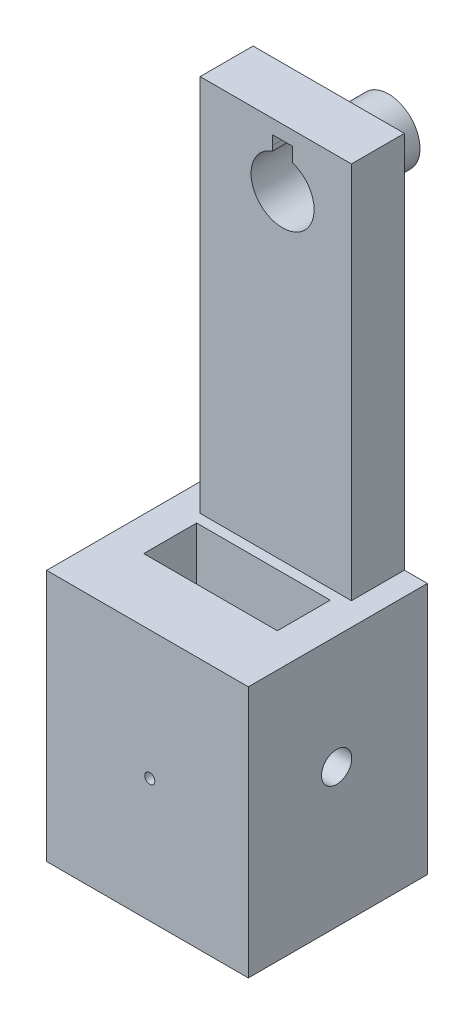
ISO-10303-21;
HEADER;
FILE_DESCRIPTION(('STEP AP214'),'2;1');
FILE_NAME('part.step','',(''),(''),'','','');
FILE_SCHEMA(('AUTOMOTIVE_DESIGN { 1 0 10303 214 1 1 1 1 }'));
ENDSEC;
DATA;
#1=APPLICATION_CONTEXT('core data for automotive mechanical design processes');
#2=APPLICATION_PROTOCOL_DEFINITION('international standard','automotive_design',2000,#1);
#3=PRODUCT_CONTEXT('',#1,'mechanical');
#4=PRODUCT('Part','Part','',(#3));
#5=PRODUCT_RELATED_PRODUCT_CATEGORY('part','',(#4));
#6=PRODUCT_DEFINITION_FORMATION('','',#4);
#7=PRODUCT_DEFINITION_CONTEXT('part definition',#1,'design');
#8=PRODUCT_DEFINITION('design','',#6,#7);
#9=PRODUCT_DEFINITION_SHAPE('','',#8);
#10=(LENGTH_UNIT() NAMED_UNIT(*) SI_UNIT(.MILLI.,.METRE.));
#11=(NAMED_UNIT(*) PLANE_ANGLE_UNIT() SI_UNIT($,.RADIAN.));
#12=(NAMED_UNIT(*) SI_UNIT($,.STERADIAN.) SOLID_ANGLE_UNIT());
#13=UNCERTAINTY_MEASURE_WITH_UNIT(LENGTH_MEASURE(1.E-05),#10,'distance_accuracy_value','');
#14=(GEOMETRIC_REPRESENTATION_CONTEXT(3) GLOBAL_UNCERTAINTY_ASSIGNED_CONTEXT((#13)) GLOBAL_UNIT_ASSIGNED_CONTEXT((#10,
#11,#12)) REPRESENTATION_CONTEXT('',''));
#15=CARTESIAN_POINT('',(0.,0.,0.));
#16=DIRECTION('',(0.,0.,1.));
#17=DIRECTION('',(1.,0.,0.));
#18=AXIS2_PLACEMENT_3D('',#15,#16,#17);
#19=CARTESIAN_POINT('',(-25.012791673449,9.50780152048557,-22.));
#20=DIRECTION('',(0.,0.,1.));
#21=DIRECTION('',(1.,0.,0.));
#22=AXIS2_PLACEMENT_3D('',#19,#20,#21);
#23=CYLINDRICAL_SURFACE('',#22,12.5);
#24=CARTESIAN_POINT('',(-25.012791673449,9.50780152048557,-22.));
#25=DIRECTION('',(0.,0.,-1.));
#26=DIRECTION('',(-1.,0.,0.));
#27=AXIS2_PLACEMENT_3D('',#24,#25,#26);
#28=CIRCLE('',#27,12.5);
#29=CARTESIAN_POINT('',(-37.512791673449,9.50780152048557,-22.));
#30=VERTEX_POINT('',#29);
#31=EDGE_CURVE('E11',#30,#30,#28,.T.);
#32=ORIENTED_EDGE('',*,*,#31,.F.);
#33=EDGE_LOOP('',(#32));
#34=FACE_BOUND('',#33,.T.);
#35=CARTESIAN_POINT('',(-25.012791673449,9.50780152048557,-2.));
#36=DIRECTION('',(0.,0.,-1.));
#37=DIRECTION('',(-1.,0.,0.));
#38=AXIS2_PLACEMENT_3D('',#35,#36,#37);
#39=CIRCLE('',#38,12.5);
#40=CARTESIAN_POINT('',(-37.512791673449,9.50780152048557,-2.));
#41=VERTEX_POINT('',#40);
#42=EDGE_CURVE('E53',#41,#41,#39,.T.);
#43=ORIENTED_EDGE('',*,*,#42,.T.);
#44=EDGE_LOOP('',(#43));
#45=FACE_BOUND('',#44,.T.);
#46=ADVANCED_FACE('F50',(#34,#45),#23,.T.);
#47=CARTESIAN_POINT('',(-25.012791673449,9.50780152048557,-22.));
#48=DIRECTION('',(0.,0.,-1.));
#49=DIRECTION('',(-1.,0.,0.));
#50=AXIS2_PLACEMENT_3D('',#47,#48,#49);
#51=PLANE('',#50);
#52=ORIENTED_EDGE('',*,*,#31,.T.);
#53=EDGE_LOOP('',(#52));
#54=FACE_BOUND('',#53,.T.);
#55=ADVANCED_FACE('F67',(#54),#51,.T.);
#56=CARTESIAN_POINT('',(-25.012791673449,9.50780152048557,-2.));
#57=DIRECTION('',(0.,0.,-1.));
#58=DIRECTION('',(-1.,0.,0.));
#59=AXIS2_PLACEMENT_3D('',#56,#57,#58);
#60=PLANE('',#59);
#61=ORIENTED_EDGE('',*,*,#42,.F.);
#62=EDGE_LOOP('',(#61));
#63=FACE_BOUND('',#62,.T.);
#64=ADVANCED_FACE('F65',(#63),#60,.F.);
#65=CLOSED_SHELL('',(#46,#55,#64));
#66=MANIFOLD_SOLID_BREP('B2',#65);
#67=CARTESIAN_POINT('',(-68.5841313388752,0.,-1.));
#68=DIRECTION('',(-1.,0.,0.));
#69=DIRECTION('',(0.,-1.,0.));
#70=AXIS2_PLACEMENT_3D('',#67,#68,#69);
#71=PLANE('',#70);
#72=CARTESIAN_POINT('',(-68.5841313388752,-162.375665535262,35.));
#73=DIRECTION('',(-1.,0.,0.));
#74=DIRECTION('',(0.,-1.,0.));
#75=AXIS2_PLACEMENT_3D('',#72,#73,#74);
#76=CIRCLE('',#75,6.);
#77=CARTESIAN_POINT('',(-68.5841313388752,-168.375665535262,35.));
#78=VERTEX_POINT('',#77);
#79=EDGE_CURVE('E428',#78,#78,#76,.T.);
#80=ORIENTED_EDGE('',*,*,#79,.F.);
#81=EDGE_LOOP('',(#80));
#82=FACE_BOUND('',#81,.T.);
#83=DIRECTION('',(0.,0.,1.));
#84=VECTOR('',#83,1.);
#85=CARTESIAN_POINT('',(-68.5841313388752,-217.375665535262,-1.));
#86=LINE('',#85,#84);
#87=CARTESIAN_POINT('',(-68.5841313388752,-217.375665535262,-1.));
#88=VERTEX_POINT('',#87);
#89=CARTESIAN_POINT('',(-68.5841313388752,-217.375665535262,70.));
#90=VERTEX_POINT('',#89);
#91=EDGE_CURVE('E402',#88,#90,#86,.T.);
#92=ORIENTED_EDGE('',*,*,#91,.T.);
#93=DIRECTION('',(0.,-1.,0.));
#94=VECTOR('',#93,1.);
#95=CARTESIAN_POINT('',(-68.5841313388752,-217.375665535262,70.));
#96=LINE('',#95,#94);
#97=CARTESIAN_POINT('',(-68.5841313388752,-117.375665535262,70.));
#98=VERTEX_POINT('',#97);
#99=EDGE_CURVE('E271',#98,#90,#96,.T.);
#100=ORIENTED_EDGE('',*,*,#99,.F.);
#101=DIRECTION('',(0.,0.,1.));
#102=VECTOR('',#101,1.);
#103=CARTESIAN_POINT('',(-68.5841313388752,-117.375665535262,-1.));
#104=LINE('',#103,#102);
#105=CARTESIAN_POINT('',(-68.5841313388752,-117.375665535262,-1.));
#106=VERTEX_POINT('',#105);
#107=EDGE_CURVE('E380',#106,#98,#104,.T.);
#108=ORIENTED_EDGE('',*,*,#107,.F.);
#109=DIRECTION('',(0.,-1.,0.));
#110=VECTOR('',#109,1.);
#111=CARTESIAN_POINT('',(-68.5841313388752,0.,-1.));
#112=LINE('',#111,#110);
#113=EDGE_CURVE('E348',#106,#88,#112,.T.);
#114=ORIENTED_EDGE('',*,*,#113,.T.);
#115=EDGE_LOOP('',(#92,#100,#108,#114));
#116=FACE_BOUND('',#115,.T.);
#117=ADVANCED_FACE('F95',(#82,#116),#71,.T.);
#118=CARTESIAN_POINT('',(-1.49699533291543E-13,-117.375665535262,-1.));
#119=DIRECTION('',(0.,1.,0.));
#120=DIRECTION('',(-1.,0.,0.));
#121=AXIS2_PLACEMENT_3D('',#118,#119,#120);
#122=PLANE('',#121);
#123=DIRECTION('',(0.,0.,1.));
#124=VECTOR('',#123,1.);
#125=CARTESIAN_POINT('',(-55.0841313388752,-117.375665535262,-1.00000000000004));
#126=LINE('',#125,#124);
#127=CARTESIAN_POINT('',(-55.0841313388752,-117.375665535262,24.));
#128=VERTEX_POINT('',#127);
#129=CARTESIAN_POINT('',(-55.0841313388752,-117.375665535262,45.));
#130=VERTEX_POINT('',#129);
#131=EDGE_CURVE('E268',#128,#130,#126,.T.);
#132=ORIENTED_EDGE('',*,*,#131,.F.);
#133=DIRECTION('',(-1.,0.,0.));
#134=VECTOR('',#133,1.);
#135=CARTESIAN_POINT('',(-1.49699533291543E-13,-117.375665535262,24.));
#136=LINE('',#135,#134);
#137=CARTESIAN_POINT('',(-2.08413133887517,-117.375665535262,24.));
#138=VERTEX_POINT('',#137);
#139=EDGE_CURVE('E256',#138,#128,#136,.T.);
#140=ORIENTED_EDGE('',*,*,#139,.F.);
#141=DIRECTION('',(0.,0.,-1.));
#142=VECTOR('',#141,1.);
#143=CARTESIAN_POINT('',(-2.08413133887516,-117.375665535262,-1.));
#144=LINE('',#143,#142);
#145=CARTESIAN_POINT('',(-2.08413133887517,-117.375665535262,45.));
#146=VERTEX_POINT('',#145);
#147=EDGE_CURVE('E229',#146,#138,#144,.T.);
#148=ORIENTED_EDGE('',*,*,#147,.F.);
#149=DIRECTION('',(1.,0.,0.));
#150=VECTOR('',#149,1.);
#151=CARTESIAN_POINT('',(-1.61744405728514E-13,-117.375665535262,45.));
#152=LINE('',#151,#150);
#153=EDGE_CURVE('E265',#130,#146,#152,.T.);
#154=ORIENTED_EDGE('',*,*,#153,.F.);
#155=EDGE_LOOP('',(#132,#140,#148,#154));
#156=FACE_BOUND('',#155,.T.);
#157=ORIENTED_EDGE('',*,*,#107,.T.);
#158=DIRECTION('',(-1.,0.,0.));
#159=VECTOR('',#158,1.);
#160=CARTESIAN_POINT('',(-68.5841313388752,-117.375665535262,70.));
#161=LINE('',#160,#159);
#162=CARTESIAN_POINT('',(11.4158686611248,-117.375665535262,70.));
#163=VERTEX_POINT('',#162);
#164=EDGE_CURVE('E283',#163,#98,#161,.T.);
#165=ORIENTED_EDGE('',*,*,#164,.F.);
#166=DIRECTION('',(0.,0.,1.));
#167=VECTOR('',#166,1.);
#168=CARTESIAN_POINT('',(11.4158686611248,-117.375665535262,-1.));
#169=LINE('',#168,#167);
#170=CARTESIAN_POINT('',(11.4158686611248,-117.375665535262,-1.));
#171=VERTEX_POINT('',#170);
#172=EDGE_CURVE('E396',#171,#163,#169,.T.);
#173=ORIENTED_EDGE('',*,*,#172,.F.);
#174=DIRECTION('',(1.,0.,0.));
#175=VECTOR('',#174,1.);
#176=CARTESIAN_POINT('',(-1.00745630340575E-13,-117.375665535262,-1.));
#177=LINE('',#176,#175);
#178=CARTESIAN_POINT('',(2.29709550454471,-117.375665535262,-1.));
#179=VERTEX_POINT('',#178);
#180=EDGE_CURVE('E359',#179,#171,#177,.T.);
#181=ORIENTED_EDGE('',*,*,#180,.F.);
#182=DIRECTION('',(0.,0.,1.));
#183=VECTOR('',#182,1.);
#184=CARTESIAN_POINT('',(2.29709550454471,-117.375665535262,-1.));
#185=LINE('',#184,#183);
#186=CARTESIAN_POINT('',(2.29709550454471,-117.375665535262,20.));
#187=VERTEX_POINT('',#186);
#188=EDGE_CURVE('E392',#179,#187,#185,.T.);
#189=ORIENTED_EDGE('',*,*,#188,.T.);
#190=DIRECTION('',(-1.,0.,0.));
#191=VECTOR('',#190,1.);
#192=CARTESIAN_POINT('',(-68.5841313388752,-117.375665535262,20.));
#193=LINE('',#192,#191);
#194=CARTESIAN_POINT('',(-57.7029044954553,-117.375665535262,20.));
#195=VERTEX_POINT('',#194);
#196=EDGE_CURVE('E48',#187,#195,#193,.T.);
#197=ORIENTED_EDGE('',*,*,#196,.T.);
#198=DIRECTION('',(0.,0.,1.));
#199=VECTOR('',#198,1.);
#200=CARTESIAN_POINT('',(-57.7029044954553,-117.375665535262,-1.));
#201=LINE('',#200,#199);
#202=CARTESIAN_POINT('',(-57.7029044954553,-117.375665535262,-1.));
#203=VERTEX_POINT('',#202);
#204=EDGE_CURVE('E383',#203,#195,#201,.T.);
#205=ORIENTED_EDGE('',*,*,#204,.F.);
#206=DIRECTION('',(-1.,0.,0.));
#207=VECTOR('',#206,1.);
#208=CARTESIAN_POINT('',(-1.49699533291543E-13,-117.375665535262,-1.));
#209=LINE('',#208,#207);
#210=EDGE_CURVE('E375',#203,#106,#209,.T.);
#211=ORIENTED_EDGE('',*,*,#210,.T.);
#212=EDGE_LOOP('',(#157,#165,#173,#181,#189,#197,#205,#211));
#213=FACE_BOUND('',#212,.T.);
#214=ADVANCED_FACE('F459',(#156,#213),#122,.T.);
#215=CARTESIAN_POINT('',(-57.7029044954553,0.,-1.));
#216=DIRECTION('',(-1.,0.,0.));
#217=DIRECTION('',(0.,-1.,0.));
#218=AXIS2_PLACEMENT_3D('',#215,#216,#217);
#219=PLANE('',#218);
#220=ORIENTED_EDGE('',*,*,#204,.T.);
#221=DIRECTION('',(0.,-1.,0.));
#222=VECTOR('',#221,1.);
#223=CARTESIAN_POINT('',(-57.7029044954553,0.,20.));
#224=LINE('',#223,#222);
#225=CARTESIAN_POINT('',(-57.7029044954553,32.6243344647382,20.));
#226=VERTEX_POINT('',#225);
#227=EDGE_CURVE('E330',#226,#195,#224,.T.);
#228=ORIENTED_EDGE('',*,*,#227,.F.);
#229=DIRECTION('',(0.,0.,1.));
#230=VECTOR('',#229,1.);
#231=CARTESIAN_POINT('',(-57.7029044954553,32.6243344647382,-1.));
#232=LINE('',#231,#230);
#233=CARTESIAN_POINT('',(-57.7029044954553,32.6243344647382,-1.));
#234=VERTEX_POINT('',#233);
#235=EDGE_CURVE('E386',#234,#226,#232,.T.);
#236=ORIENTED_EDGE('',*,*,#235,.F.);
#237=DIRECTION('',(0.,-1.,0.));
#238=VECTOR('',#237,1.);
#239=CARTESIAN_POINT('',(-57.7029044954553,0.,-1.));
#240=LINE('',#239,#238);
#241=EDGE_CURVE('E371',#234,#203,#240,.T.);
#242=ORIENTED_EDGE('',*,*,#241,.T.);
#243=EDGE_LOOP('',(#220,#228,#236,#242));
#244=FACE_BOUND('',#243,.T.);
#245=ADVANCED_FACE('F465',(#244),#219,.T.);
#246=CARTESIAN_POINT('',(0.,32.6243344647383,-1.));
#247=DIRECTION('',(0.,-1.,0.));
#248=DIRECTION('',(1.,0.,0.));
#249=AXIS2_PLACEMENT_3D('',#246,#247,#248);
#250=PLANE('',#249);
#251=ORIENTED_EDGE('',*,*,#235,.T.);
#252=DIRECTION('',(1.,0.,0.));
#253=VECTOR('',#252,1.);
#254=CARTESIAN_POINT('',(0.,32.6243344647383,20.));
#255=LINE('',#254,#253);
#256=CARTESIAN_POINT('',(2.29709550454469,32.6243344647383,20.));
#257=VERTEX_POINT('',#256);
#258=EDGE_CURVE('E326',#226,#257,#255,.T.);
#259=ORIENTED_EDGE('',*,*,#258,.T.);
#260=DIRECTION('',(0.,0.,1.));
#261=VECTOR('',#260,1.);
#262=CARTESIAN_POINT('',(2.29709550454469,32.6243344647383,-1.));
#263=LINE('',#262,#261);
#264=CARTESIAN_POINT('',(2.29709550454469,32.6243344647383,-1.));
#265=VERTEX_POINT('',#264);
#266=EDGE_CURVE('E389',#265,#257,#263,.T.);
#267=ORIENTED_EDGE('',*,*,#266,.F.);
#268=DIRECTION('',(1.,0.,0.));
#269=VECTOR('',#268,1.);
#270=CARTESIAN_POINT('',(0.,32.6243344647383,-1.));
#271=LINE('',#270,#269);
#272=EDGE_CURVE('E367',#234,#265,#271,.T.);
#273=ORIENTED_EDGE('',*,*,#272,.F.);
#274=EDGE_LOOP('',(#251,#259,#267,#273));
#275=FACE_BOUND('',#274,.T.);
#276=ADVANCED_FACE('F530',(#275),#250,.F.);
#277=CARTESIAN_POINT('',(2.29709550454469,0.,-1.));
#278=DIRECTION('',(-1.,0.,0.));
#279=DIRECTION('',(0.,-1.,0.));
#280=AXIS2_PLACEMENT_3D('',#277,#278,#279);
#281=PLANE('',#280);
#282=ORIENTED_EDGE('',*,*,#266,.T.);
#283=DIRECTION('',(0.,-1.,0.));
#284=VECTOR('',#283,1.);
#285=CARTESIAN_POINT('',(2.29709550454469,0.,20.));
#286=LINE('',#285,#284);
#287=EDGE_CURVE('E322',#257,#187,#286,.T.);
#288=ORIENTED_EDGE('',*,*,#287,.T.);
#289=ORIENTED_EDGE('',*,*,#188,.F.);
#290=DIRECTION('',(0.,-1.,0.));
#291=VECTOR('',#290,1.);
#292=CARTESIAN_POINT('',(2.29709550454469,0.,-1.));
#293=LINE('',#292,#291);
#294=EDGE_CURVE('E363',#265,#179,#293,.T.);
#295=ORIENTED_EDGE('',*,*,#294,.F.);
#296=EDGE_LOOP('',(#282,#288,#289,#295));
#297=FACE_BOUND('',#296,.T.);
#298=ADVANCED_FACE('F534',(#297),#281,.F.);
#299=CARTESIAN_POINT('',(11.4158686611248,0.,-1.));
#300=DIRECTION('',(-1.,0.,0.));
#301=DIRECTION('',(0.,-1.,0.));
#302=AXIS2_PLACEMENT_3D('',#299,#300,#301);
#303=PLANE('',#302);
#304=CARTESIAN_POINT('',(11.4158686611249,-162.375665535262,35.));
#305=DIRECTION('',(-1.,0.,0.));
#306=DIRECTION('',(0.,-1.,0.));
#307=AXIS2_PLACEMENT_3D('',#304,#305,#306);
#308=CIRCLE('',#307,6.);
#309=CARTESIAN_POINT('',(11.4158686611249,-168.375665535262,35.));
#310=VERTEX_POINT('',#309);
#311=EDGE_CURVE('E419',#310,#310,#308,.T.);
#312=ORIENTED_EDGE('',*,*,#311,.T.);
#313=EDGE_LOOP('',(#312));
#314=FACE_BOUND('',#313,.T.);
#315=ORIENTED_EDGE('',*,*,#172,.T.);
#316=DIRECTION('',(0.,1.,0.));
#317=VECTOR('',#316,1.);
#318=CARTESIAN_POINT('',(11.4158686611248,-117.375665535262,70.));
#319=LINE('',#318,#317);
#320=CARTESIAN_POINT('',(11.4158686611248,-217.375665535262,70.));
#321=VERTEX_POINT('',#320);
#322=EDGE_CURVE('E279',#321,#163,#319,.T.);
#323=ORIENTED_EDGE('',*,*,#322,.F.);
#324=DIRECTION('',(0.,0.,1.));
#325=VECTOR('',#324,1.);
#326=CARTESIAN_POINT('',(11.4158686611248,-217.375665535262,-1.));
#327=LINE('',#326,#325);
#328=CARTESIAN_POINT('',(11.4158686611248,-217.375665535262,-1.));
#329=VERTEX_POINT('',#328);
#330=EDGE_CURVE('E399',#329,#321,#327,.T.);
#331=ORIENTED_EDGE('',*,*,#330,.F.);
#332=DIRECTION('',(0.,-1.,0.));
#333=VECTOR('',#332,1.);
#334=CARTESIAN_POINT('',(11.4158686611248,0.,-1.));
#335=LINE('',#334,#333);
#336=EDGE_CURVE('E356',#171,#329,#335,.T.);
#337=ORIENTED_EDGE('',*,*,#336,.F.);
#338=EDGE_LOOP('',(#315,#323,#331,#337));
#339=FACE_BOUND('',#338,.T.);
#340=ADVANCED_FACE('F537',(#314,#339),#303,.F.);
#341=CARTESIAN_POINT('',(-25.012791673449,9.50780152048557,-1.));
#342=DIRECTION('',(0.,0.,1.));
#343=DIRECTION('',(1.,0.,0.));
#344=AXIS2_PLACEMENT_3D('',#341,#342,#343);
#345=CYLINDRICAL_SURFACE('',#344,12.5);
#346=CARTESIAN_POINT('',(-25.012791673449,9.50780152048557,-1.));
#347=DIRECTION('',(0.,0.,1.));
#348=DIRECTION('',(1.,0.,0.));
#349=AXIS2_PLACEMENT_3D('',#346,#347,#348);
#350=CIRCLE('',#349,12.5);
#351=CARTESIAN_POINT('',(-29.0592239651956,21.3347362758781,-1.));
#352=VERTEX_POINT('',#351);
#353=CARTESIAN_POINT('',(-21.012791673449,21.3505208028126,-1.));
#354=VERTEX_POINT('',#353);
#355=EDGE_CURVE('E334',#352,#354,#350,.T.);
#356=ORIENTED_EDGE('',*,*,#355,.F.);
#357=DIRECTION('',(0.,0.,1.));
#358=VECTOR('',#357,1.);
#359=CARTESIAN_POINT('',(-29.0592239651956,21.3347362758781,-1.));
#360=LINE('',#359,#358);
#361=CARTESIAN_POINT('',(-29.0592239651956,21.3347362758781,20.));
#362=VERTEX_POINT('',#361);
#363=EDGE_CURVE('E303',#352,#362,#360,.T.);
#364=ORIENTED_EDGE('',*,*,#363,.T.);
#365=CARTESIAN_POINT('',(-25.012791673449,9.50780152048557,20.));
#366=DIRECTION('',(0.,0.,1.));
#367=DIRECTION('',(1.,0.,0.));
#368=AXIS2_PLACEMENT_3D('',#365,#366,#367);
#369=CIRCLE('',#368,12.5);
#370=CARTESIAN_POINT('',(-21.012791673449,21.3505208028126,20.));
#371=VERTEX_POINT('',#370);
#372=EDGE_CURVE('E307',#362,#371,#369,.T.);
#373=ORIENTED_EDGE('',*,*,#372,.T.);
#374=DIRECTION('',(0.,0.,1.));
#375=VECTOR('',#374,1.);
#376=CARTESIAN_POINT('',(-21.012791673449,21.3505208028126,-1.));
#377=LINE('',#376,#375);
#378=EDGE_CURVE('E405',#354,#371,#377,.T.);
#379=ORIENTED_EDGE('',*,*,#378,.F.);
#380=EDGE_LOOP('',(#356,#364,#373,#379));
#381=FACE_BOUND('',#380,.T.);
#382=ADVANCED_FACE('F97',(#381),#345,.F.);
#383=CARTESIAN_POINT('',(-21.012791673449,0.,-1.));
#384=DIRECTION('',(-1.,0.,0.));
#385=DIRECTION('',(0.,-1.,0.));
#386=AXIS2_PLACEMENT_3D('',#383,#384,#385);
#387=PLANE('',#386);
#388=ORIENTED_EDGE('',*,*,#378,.T.);
#389=DIRECTION('',(0.,-1.,0.));
#390=VECTOR('',#389,1.);
#391=CARTESIAN_POINT('',(-21.012791673449,0.,20.));
#392=LINE('',#391,#390);
#393=CARTESIAN_POINT('',(-21.012791673449,27.0078015204856,20.));
#394=VERTEX_POINT('',#393);
#395=EDGE_CURVE('E318',#394,#371,#392,.T.);
#396=ORIENTED_EDGE('',*,*,#395,.F.);
#397=DIRECTION('',(0.,0.,1.));
#398=VECTOR('',#397,1.);
#399=CARTESIAN_POINT('',(-21.012791673449,27.0078015204856,-1.));
#400=LINE('',#399,#398);
#401=CARTESIAN_POINT('',(-21.012791673449,27.0078015204856,-1.));
#402=VERTEX_POINT('',#401);
#403=EDGE_CURVE('E409',#402,#394,#400,.T.);
#404=ORIENTED_EDGE('',*,*,#403,.F.);
#405=DIRECTION('',(0.,-1.,0.));
#406=VECTOR('',#405,1.);
#407=CARTESIAN_POINT('',(-21.012791673449,0.,-1.));
#408=LINE('',#407,#406);
#409=EDGE_CURVE('E344',#402,#354,#408,.T.);
#410=ORIENTED_EDGE('',*,*,#409,.T.);
#411=EDGE_LOOP('',(#388,#396,#404,#410));
#412=FACE_BOUND('',#411,.T.);
#413=ADVANCED_FACE('F473',(#412),#387,.T.);
#414=CARTESIAN_POINT('',(0.,27.0078015204856,-1.));
#415=DIRECTION('',(0.,1.,0.));
#416=DIRECTION('',(0.,0.,1.));
#417=AXIS2_PLACEMENT_3D('',#414,#415,#416);
#418=PLANE('',#417);
#419=ORIENTED_EDGE('',*,*,#403,.T.);
#420=DIRECTION('',(-1.,0.,0.));
#421=VECTOR('',#420,1.);
#422=CARTESIAN_POINT('',(0.,27.0078015204856,20.));
#423=LINE('',#422,#421);
#424=CARTESIAN_POINT('',(-29.012791673449,27.0078015204856,20.));
#425=VERTEX_POINT('',#424);
#426=EDGE_CURVE('E314',#394,#425,#423,.T.);
#427=ORIENTED_EDGE('',*,*,#426,.T.);
#428=DIRECTION('',(0.,0.,1.));
#429=VECTOR('',#428,1.);
#430=CARTESIAN_POINT('',(-29.012791673449,27.0078015204856,-1.));
#431=LINE('',#430,#429);
#432=CARTESIAN_POINT('',(-29.012791673449,27.0078015204856,-1.));
#433=VERTEX_POINT('',#432);
#434=EDGE_CURVE('E379',#433,#425,#431,.T.);
#435=ORIENTED_EDGE('',*,*,#434,.F.);
#436=DIRECTION('',(-1.,0.,0.));
#437=VECTOR('',#436,1.);
#438=CARTESIAN_POINT('',(0.,27.0078015204856,-1.));
#439=LINE('',#438,#437);
#440=EDGE_CURVE('E341',#402,#433,#439,.T.);
#441=ORIENTED_EDGE('',*,*,#440,.F.);
#442=EDGE_LOOP('',(#419,#427,#435,#441));
#443=FACE_BOUND('',#442,.T.);
#444=ADVANCED_FACE('F476',(#443),#418,.F.);
#445=CARTESIAN_POINT('',(-29.012791673449,0.,-1.));
#446=DIRECTION('',(-1.,0.,0.));
#447=DIRECTION('',(0.,0.,1.));
#448=AXIS2_PLACEMENT_3D('',#445,#446,#447);
#449=PLANE('',#448);
#450=DIRECTION('',(0.,-1.,0.));
#451=VECTOR('',#450,1.);
#452=CARTESIAN_POINT('',(-29.012791673449,0.,20.));
#453=LINE('',#452,#451);
#454=CARTESIAN_POINT('',(-29.012791673449,23.3098864285049,20.));
#455=VERTEX_POINT('',#454);
#456=EDGE_CURVE('E310',#425,#455,#453,.T.);
#457=ORIENTED_EDGE('',*,*,#456,.T.);
#458=DIRECTION('',(0.,0.,-1.));
#459=VECTOR('',#458,1.);
#460=CARTESIAN_POINT('',(-29.012791673449,23.3098864285049,-1.));
#461=LINE('',#460,#459);
#462=CARTESIAN_POINT('',(-29.012791673449,23.3098864285049,-1.));
#463=VERTEX_POINT('',#462);
#464=EDGE_CURVE('E300',#455,#463,#461,.T.);
#465=ORIENTED_EDGE('',*,*,#464,.T.);
#466=DIRECTION('',(0.,-1.,0.));
#467=VECTOR('',#466,1.);
#468=CARTESIAN_POINT('',(-29.012791673449,0.,-1.));
#469=LINE('',#468,#467);
#470=EDGE_CURVE('E337',#433,#463,#469,.T.);
#471=ORIENTED_EDGE('',*,*,#470,.F.);
#472=ORIENTED_EDGE('',*,*,#434,.T.);
#473=EDGE_LOOP('',(#457,#465,#471,#472));
#474=FACE_BOUND('',#473,.T.);
#475=ADVANCED_FACE('F479',(#474),#449,.F.);
#476=CARTESIAN_POINT('',(0.,-217.375665535262,-1.));
#477=DIRECTION('',(0.,-1.,0.));
#478=DIRECTION('',(0.,0.,-1.));
#479=AXIS2_PLACEMENT_3D('',#476,#477,#478);
#480=PLANE('',#479);
#481=DIRECTION('',(0.,0.,-1.));
#482=VECTOR('',#481,1.);
#483=CARTESIAN_POINT('',(-55.0841313388752,-217.375665535262,24.));
#484=LINE('',#483,#482);
#485=CARTESIAN_POINT('',(-55.0841313388752,-217.375665535262,45.));
#486=VERTEX_POINT('',#485);
#487=CARTESIAN_POINT('',(-55.0841313388752,-217.375665535262,24.));
#488=VERTEX_POINT('',#487);
#489=EDGE_CURVE('E121',#486,#488,#484,.T.);
#490=ORIENTED_EDGE('',*,*,#489,.F.);
#491=DIRECTION('',(-1.,0.,0.));
#492=VECTOR('',#491,1.);
#493=CARTESIAN_POINT('',(-55.0841313388752,-217.375665535262,45.));
#494=LINE('',#493,#492);
#495=CARTESIAN_POINT('',(-2.08413133887517,-217.375665535262,45.));
#496=VERTEX_POINT('',#495);
#497=EDGE_CURVE('E244',#496,#486,#494,.T.);
#498=ORIENTED_EDGE('',*,*,#497,.F.);
#499=DIRECTION('',(0.,0.,1.));
#500=VECTOR('',#499,1.);
#501=CARTESIAN_POINT('',(-2.08413133887517,-217.375665535262,24.));
#502=LINE('',#501,#500);
#503=CARTESIAN_POINT('',(-2.08413133887517,-217.375665535262,24.));
#504=VERTEX_POINT('',#503);
#505=EDGE_CURVE('E226',#504,#496,#502,.T.);
#506=ORIENTED_EDGE('',*,*,#505,.F.);
#507=DIRECTION('',(1.,0.,0.));
#508=VECTOR('',#507,1.);
#509=CARTESIAN_POINT('',(-55.0841313388752,-217.375665535262,24.));
#510=LINE('',#509,#508);
#511=EDGE_CURVE('E236',#488,#504,#510,.T.);
#512=ORIENTED_EDGE('',*,*,#511,.F.);
#513=EDGE_LOOP('',(#490,#498,#506,#512));
#514=FACE_BOUND('',#513,.T.);
#515=ORIENTED_EDGE('',*,*,#330,.T.);
#516=DIRECTION('',(1.,0.,0.));
#517=VECTOR('',#516,1.);
#518=CARTESIAN_POINT('',(11.4158686611248,-217.375665535262,70.));
#519=LINE('',#518,#517);
#520=EDGE_CURVE('E275',#90,#321,#519,.T.);
#521=ORIENTED_EDGE('',*,*,#520,.F.);
#522=ORIENTED_EDGE('',*,*,#91,.F.);
#523=DIRECTION('',(1.,0.,0.));
#524=VECTOR('',#523,1.);
#525=CARTESIAN_POINT('',(0.,-217.375665535262,-1.));
#526=LINE('',#525,#524);
#527=EDGE_CURVE('E352',#88,#329,#526,.T.);
#528=ORIENTED_EDGE('',*,*,#527,.T.);
#529=EDGE_LOOP('',(#515,#521,#522,#528));
#530=FACE_BOUND('',#529,.T.);
#531=ADVANCED_FACE('F241',(#514,#530),#480,.T.);
#532=CARTESIAN_POINT('',(0.,0.,-1.));
#533=DIRECTION('',(0.,0.,1.));
#534=DIRECTION('',(1.,0.,0.));
#535=AXIS2_PLACEMENT_3D('',#532,#533,#534);
#536=PLANE('',#535);
#537=DIRECTION('',(1.,0.,0.));
#538=VECTOR('',#537,1.);
#539=CARTESIAN_POINT('',(-29.0592239651956,23.3098864285049,-1.));
#540=LINE('',#539,#538);
#541=CARTESIAN_POINT('',(-29.0592239651956,23.3098864285049,-1.));
#542=VERTEX_POINT('',#541);
#543=EDGE_CURVE('E292',#542,#463,#540,.T.);
#544=ORIENTED_EDGE('',*,*,#543,.F.);
#545=DIRECTION('',(0.,1.,0.));
#546=VECTOR('',#545,1.);
#547=CARTESIAN_POINT('',(-29.0592239651956,8.30988642850489,-1.));
#548=LINE('',#547,#546);
#549=EDGE_CURVE('E285',#352,#542,#548,.T.);
#550=ORIENTED_EDGE('',*,*,#549,.F.);
#551=ORIENTED_EDGE('',*,*,#355,.T.);
#552=ORIENTED_EDGE('',*,*,#409,.F.);
#553=ORIENTED_EDGE('',*,*,#440,.T.);
#554=ORIENTED_EDGE('',*,*,#470,.T.);
#555=EDGE_LOOP('',(#544,#550,#551,#552,#553,#554));
#556=FACE_BOUND('',#555,.T.);
#557=ORIENTED_EDGE('',*,*,#113,.F.);
#558=ORIENTED_EDGE('',*,*,#210,.F.);
#559=ORIENTED_EDGE('',*,*,#241,.F.);
#560=ORIENTED_EDGE('',*,*,#272,.T.);
#561=ORIENTED_EDGE('',*,*,#294,.T.);
#562=ORIENTED_EDGE('',*,*,#180,.T.);
#563=ORIENTED_EDGE('',*,*,#336,.T.);
#564=ORIENTED_EDGE('',*,*,#527,.F.);
#565=EDGE_LOOP('',(#557,#558,#559,#560,#561,#562,#563,#564));
#566=FACE_BOUND('',#565,.T.);
#567=ADVANCED_FACE('F486',(#556,#566),#536,.F.);
#568=CARTESIAN_POINT('',(0.,0.,20.));
#569=DIRECTION('',(0.,0.,1.));
#570=DIRECTION('',(1.,0.,0.));
#571=AXIS2_PLACEMENT_3D('',#568,#569,#570);
#572=PLANE('',#571);
#573=ORIENTED_EDGE('',*,*,#196,.F.);
#574=ORIENTED_EDGE('',*,*,#287,.F.);
#575=ORIENTED_EDGE('',*,*,#258,.F.);
#576=ORIENTED_EDGE('',*,*,#227,.T.);
#577=EDGE_LOOP('',(#573,#574,#575,#576));
#578=FACE_BOUND('',#577,.T.);
#579=DIRECTION('',(0.,-1.,0.));
#580=VECTOR('',#579,1.);
#581=CARTESIAN_POINT('',(-29.0592239651956,0.,20.));
#582=LINE('',#581,#580);
#583=CARTESIAN_POINT('',(-29.0592239651956,23.3098864285049,20.));
#584=VERTEX_POINT('',#583);
#585=EDGE_CURVE('E105',#584,#362,#582,.T.);
#586=ORIENTED_EDGE('',*,*,#585,.F.);
#587=DIRECTION('',(1.,0.,0.));
#588=VECTOR('',#587,1.);
#589=CARTESIAN_POINT('',(-29.0592239651956,23.3098864285049,20.));
#590=LINE('',#589,#588);
#591=EDGE_CURVE('E287',#584,#455,#590,.T.);
#592=ORIENTED_EDGE('',*,*,#591,.T.);
#593=ORIENTED_EDGE('',*,*,#456,.F.);
#594=ORIENTED_EDGE('',*,*,#426,.F.);
#595=ORIENTED_EDGE('',*,*,#395,.T.);
#596=ORIENTED_EDGE('',*,*,#372,.F.);
#597=EDGE_LOOP('',(#586,#592,#593,#594,#595,#596));
#598=FACE_BOUND('',#597,.T.);
#599=ADVANCED_FACE('F493',(#578,#598),#572,.T.);
#600=CARTESIAN_POINT('',(-29.0592239651956,8.30988642850489,20.));
#601=DIRECTION('',(-1.,0.,0.));
#602=DIRECTION('',(0.,0.,1.));
#603=AXIS2_PLACEMENT_3D('',#600,#601,#602);
#604=PLANE('',#603);
#605=ORIENTED_EDGE('',*,*,#549,.T.);
#606=DIRECTION('',(0.,0.,-1.));
#607=VECTOR('',#606,1.);
#608=CARTESIAN_POINT('',(-29.0592239651956,23.3098864285049,20.));
#609=LINE('',#608,#607);
#610=EDGE_CURVE('E291',#584,#542,#609,.T.);
#611=ORIENTED_EDGE('',*,*,#610,.F.);
#612=ORIENTED_EDGE('',*,*,#585,.T.);
#613=ORIENTED_EDGE('',*,*,#363,.F.);
#614=EDGE_LOOP('',(#605,#611,#612,#613));
#615=FACE_BOUND('',#614,.T.);
#616=ADVANCED_FACE('F504',(#615),#604,.F.);
#617=CARTESIAN_POINT('',(-29.0592239651956,23.3098864285049,20.));
#618=DIRECTION('',(0.,1.,0.));
#619=DIRECTION('',(0.,0.,1.));
#620=AXIS2_PLACEMENT_3D('',#617,#618,#619);
#621=PLANE('',#620);
#622=ORIENTED_EDGE('',*,*,#591,.F.);
#623=ORIENTED_EDGE('',*,*,#610,.T.);
#624=ORIENTED_EDGE('',*,*,#543,.T.);
#625=ORIENTED_EDGE('',*,*,#464,.F.);
#626=EDGE_LOOP('',(#622,#623,#624,#625));
#627=FACE_BOUND('',#626,.T.);
#628=ADVANCED_FACE('F509',(#627),#621,.F.);
#629=CARTESIAN_POINT('',(0.,0.,70.));
#630=DIRECTION('',(0.,0.,-1.));
#631=DIRECTION('',(-1.,0.,0.));
#632=AXIS2_PLACEMENT_3D('',#629,#630,#631);
#633=PLANE('',#632);
#634=CARTESIAN_POINT('',(-27.6672147895312,-168.370466123655,70.));
#635=DIRECTION('',(0.,0.,1.));
#636=DIRECTION('',(1.,0.,0.));
#637=AXIS2_PLACEMENT_3D('',#634,#635,#636);
#638=CIRCLE('',#637,2.);
#639=CARTESIAN_POINT('',(-25.6672147895312,-168.370466123655,70.));
#640=VERTEX_POINT('',#639);
#641=EDGE_CURVE('E436',#640,#640,#638,.T.);
#642=ORIENTED_EDGE('',*,*,#641,.F.);
#643=EDGE_LOOP('',(#642));
#644=FACE_BOUND('',#643,.T.);
#645=ORIENTED_EDGE('',*,*,#99,.T.);
#646=ORIENTED_EDGE('',*,*,#520,.T.);
#647=ORIENTED_EDGE('',*,*,#322,.T.);
#648=ORIENTED_EDGE('',*,*,#164,.T.);
#649=EDGE_LOOP('',(#645,#646,#647,#648));
#650=FACE_BOUND('',#649,.T.);
#651=ADVANCED_FACE('F511',(#644,#650),#633,.F.);
#652=CARTESIAN_POINT('',(-55.0841313388752,32.6243344647383,24.));
#653=DIRECTION('',(-1.,0.,0.));
#654=DIRECTION('',(0.,0.,1.));
#655=AXIS2_PLACEMENT_3D('',#652,#653,#654);
#656=PLANE('',#655);
#657=CARTESIAN_POINT('',(-55.0841313388752,-162.375665535262,35.));
#658=DIRECTION('',(-1.,0.,0.));
#659=DIRECTION('',(0.,0.,1.));
#660=AXIS2_PLACEMENT_3D('',#657,#658,#659);
#661=CIRCLE('',#660,6.);
#662=CARTESIAN_POINT('',(-55.0841313388752,-162.375665535262,41.));
#663=VERTEX_POINT('',#662);
#664=EDGE_CURVE('E418',#663,#663,#661,.T.);
#665=ORIENTED_EDGE('',*,*,#664,.T.);
#666=EDGE_LOOP('',(#665));
#667=FACE_BOUND('',#666,.T.);
#668=ORIENTED_EDGE('',*,*,#131,.T.);
#669=DIRECTION('',(0.,-1.,0.));
#670=VECTOR('',#669,1.);
#671=CARTESIAN_POINT('',(-55.0841313388752,32.6243344647383,45.));
#672=LINE('',#671,#670);
#673=EDGE_CURVE('E253',#130,#486,#672,.T.);
#674=ORIENTED_EDGE('',*,*,#673,.T.);
#675=ORIENTED_EDGE('',*,*,#489,.T.);
#676=DIRECTION('',(0.,-1.,0.));
#677=VECTOR('',#676,1.);
#678=CARTESIAN_POINT('',(-55.0841313388752,32.6243344647383,24.));
#679=LINE('',#678,#677);
#680=EDGE_CURVE('E233',#128,#488,#679,.T.);
#681=ORIENTED_EDGE('',*,*,#680,.F.);
#682=EDGE_LOOP('',(#668,#674,#675,#681));
#683=FACE_BOUND('',#682,.T.);
#684=ADVANCED_FACE('F517',(#667,#683),#656,.F.);
#685=CARTESIAN_POINT('',(-55.0841313388752,32.6243344647383,45.));
#686=DIRECTION('',(0.,0.,1.));
#687=DIRECTION('',(1.,0.,0.));
#688=AXIS2_PLACEMENT_3D('',#685,#686,#687);
#689=PLANE('',#688);
#690=CARTESIAN_POINT('',(-27.6672147895312,-168.370466123655,45.));
#691=DIRECTION('',(0.,0.,1.));
#692=DIRECTION('',(1.,0.,0.));
#693=AXIS2_PLACEMENT_3D('',#690,#691,#692);
#694=CIRCLE('',#693,2.);
#695=CARTESIAN_POINT('',(-25.6672147895312,-168.370466123655,45.));
#696=VERTEX_POINT('',#695);
#697=EDGE_CURVE('E99',#696,#696,#694,.T.);
#698=ORIENTED_EDGE('',*,*,#697,.T.);
#699=EDGE_LOOP('',(#698));
#700=FACE_BOUND('',#699,.T.);
#701=ORIENTED_EDGE('',*,*,#153,.T.);
#702=DIRECTION('',(0.,-1.,0.));
#703=VECTOR('',#702,1.);
#704=CARTESIAN_POINT('',(-2.08413133887517,32.6243344647383,45.));
#705=LINE('',#704,#703);
#706=EDGE_CURVE('E232',#146,#496,#705,.T.);
#707=ORIENTED_EDGE('',*,*,#706,.T.);
#708=ORIENTED_EDGE('',*,*,#497,.T.);
#709=ORIENTED_EDGE('',*,*,#673,.F.);
#710=EDGE_LOOP('',(#701,#707,#708,#709));
#711=FACE_BOUND('',#710,.T.);
#712=ADVANCED_FACE('F445',(#700,#711),#689,.F.);
#713=CARTESIAN_POINT('',(-2.08413133887517,32.6243344647383,24.));
#714=DIRECTION('',(1.,0.,0.));
#715=DIRECTION('',(0.,0.,-1.));
#716=AXIS2_PLACEMENT_3D('',#713,#714,#715);
#717=PLANE('',#716);
#718=CARTESIAN_POINT('',(-2.08413133887517,-162.375665535262,35.));
#719=DIRECTION('',(1.,0.,0.));
#720=DIRECTION('',(0.,0.,-1.));
#721=AXIS2_PLACEMENT_3D('',#718,#719,#720);
#722=CIRCLE('',#721,6.);
#723=CARTESIAN_POINT('',(-2.08413133887517,-162.375665535262,29.));
#724=VERTEX_POINT('',#723);
#725=EDGE_CURVE('E415',#724,#724,#722,.T.);
#726=ORIENTED_EDGE('',*,*,#725,.T.);
#727=EDGE_LOOP('',(#726));
#728=FACE_BOUND('',#727,.T.);
#729=ORIENTED_EDGE('',*,*,#147,.T.);
#730=DIRECTION('',(0.,-1.,0.));
#731=VECTOR('',#730,1.);
#732=CARTESIAN_POINT('',(-2.08413133887517,32.6243344647383,24.));
#733=LINE('',#732,#731);
#734=EDGE_CURVE('E113',#138,#504,#733,.T.);
#735=ORIENTED_EDGE('',*,*,#734,.T.);
#736=ORIENTED_EDGE('',*,*,#505,.T.);
#737=ORIENTED_EDGE('',*,*,#706,.F.);
#738=EDGE_LOOP('',(#729,#735,#736,#737));
#739=FACE_BOUND('',#738,.T.);
#740=ADVANCED_FACE('F223',(#728,#739),#717,.F.);
#741=CARTESIAN_POINT('',(-55.0841313388752,32.6243344647383,24.));
#742=DIRECTION('',(0.,0.,-1.));
#743=DIRECTION('',(-1.,0.,0.));
#744=AXIS2_PLACEMENT_3D('',#741,#742,#743);
#745=PLANE('',#744);
#746=ORIENTED_EDGE('',*,*,#139,.T.);
#747=ORIENTED_EDGE('',*,*,#680,.T.);
#748=ORIENTED_EDGE('',*,*,#511,.T.);
#749=ORIENTED_EDGE('',*,*,#734,.F.);
#750=EDGE_LOOP('',(#746,#747,#748,#749));
#751=FACE_BOUND('',#750,.T.);
#752=ADVANCED_FACE('F237',(#751),#745,.F.);
#753=CARTESIAN_POINT('',(11.4158686611249,-162.375665535262,35.));
#754=DIRECTION('',(-1.,0.,0.));
#755=DIRECTION('',(0.,-1.,0.));
#756=AXIS2_PLACEMENT_3D('',#753,#754,#755);
#757=CYLINDRICAL_SURFACE('',#756,6.);
#758=ORIENTED_EDGE('',*,*,#311,.F.);
#759=EDGE_LOOP('',(#758));
#760=FACE_BOUND('',#759,.T.);
#761=ORIENTED_EDGE('',*,*,#725,.F.);
#762=EDGE_LOOP('',(#761));
#763=FACE_BOUND('',#762,.T.);
#764=ADVANCED_FACE('F455',(#760,#763),#757,.F.);
#765=ORIENTED_EDGE('',*,*,#79,.T.);
#766=EDGE_LOOP('',(#765));
#767=FACE_BOUND('',#766,.T.);
#768=ORIENTED_EDGE('',*,*,#664,.F.);
#769=EDGE_LOOP('',(#768));
#770=FACE_BOUND('',#769,.T.);
#771=ADVANCED_FACE('F450',(#767,#770),#757,.F.);
#772=CARTESIAN_POINT('',(-27.6672147895312,-168.370466123655,40.));
#773=DIRECTION('',(0.,0.,1.));
#774=DIRECTION('',(1.,0.,0.));
#775=AXIS2_PLACEMENT_3D('',#772,#773,#774);
#776=CYLINDRICAL_SURFACE('',#775,2.);
#777=ORIENTED_EDGE('',*,*,#641,.T.);
#778=EDGE_LOOP('',(#777));
#779=FACE_BOUND('',#778,.T.);
#780=ORIENTED_EDGE('',*,*,#697,.F.);
#781=EDGE_LOOP('',(#780));
#782=FACE_BOUND('',#781,.T.);
#783=ADVANCED_FACE('F448',(#779,#782),#776,.F.);
#784=CLOSED_SHELL('',(#117,#214,#245,#276,#298,#340,#382,#413,#444,#475,#531,#567,#599,#616,
#628,#651,#684,#712,#740,#752,#764,#771,#783));
#785=MANIFOLD_SOLID_BREP('B6',#784);
#786=ADVANCED_BREP_SHAPE_REPRESENTATION('',(#18,#66,#785),#14);
#787=SHAPE_DEFINITION_REPRESENTATION(#9,#786);
ENDSEC;
END-ISO-10303-21;
